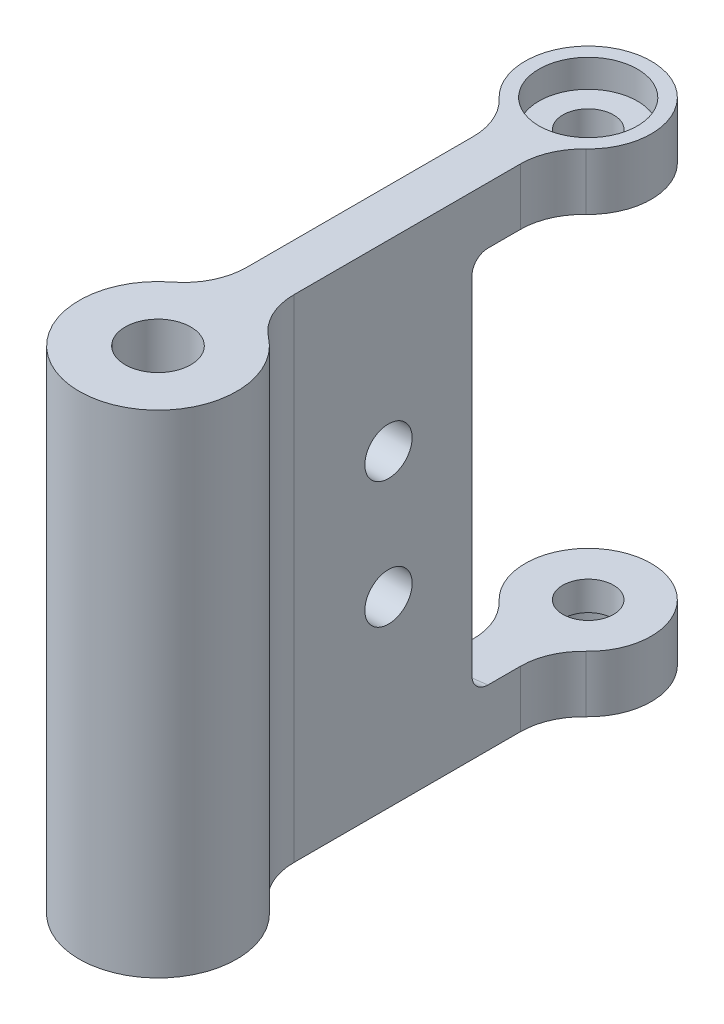
ISO-10303-21;
HEADER;
FILE_DESCRIPTION(('STEP AP214'),'2;1');
FILE_NAME('part.step','',(''),(''),'','','');
FILE_SCHEMA(('AUTOMOTIVE_DESIGN { 1 0 10303 214 1 1 1 1 }'));
ENDSEC;
DATA;
#1=APPLICATION_CONTEXT('core data for automotive mechanical design processes');
#2=APPLICATION_PROTOCOL_DEFINITION('international standard','automotive_design',2000,#1);
#3=PRODUCT_CONTEXT('',#1,'mechanical');
#4=PRODUCT('Part','Part','',(#3));
#5=PRODUCT_RELATED_PRODUCT_CATEGORY('part','',(#4));
#6=PRODUCT_DEFINITION_FORMATION('','',#4);
#7=PRODUCT_DEFINITION_CONTEXT('part definition',#1,'design');
#8=PRODUCT_DEFINITION('design','',#6,#7);
#9=PRODUCT_DEFINITION_SHAPE('','',#8);
#10=(LENGTH_UNIT() NAMED_UNIT(*) SI_UNIT(.MILLI.,.METRE.));
#11=(NAMED_UNIT(*) PLANE_ANGLE_UNIT() SI_UNIT($,.RADIAN.));
#12=(NAMED_UNIT(*) SI_UNIT($,.STERADIAN.) SOLID_ANGLE_UNIT());
#13=UNCERTAINTY_MEASURE_WITH_UNIT(LENGTH_MEASURE(1.E-05),#10,'distance_accuracy_value','');
#14=(GEOMETRIC_REPRESENTATION_CONTEXT(3) GLOBAL_UNCERTAINTY_ASSIGNED_CONTEXT((#13)) GLOBAL_UNIT_ASSIGNED_CONTEXT((#10,
#11,#12)) REPRESENTATION_CONTEXT('',''));
#15=CARTESIAN_POINT('',(0.,0.,0.));
#16=DIRECTION('',(0.,0.,1.));
#17=DIRECTION('',(1.,0.,0.));
#18=AXIS2_PLACEMENT_3D('',#15,#16,#17);
#19=CARTESIAN_POINT('',(2.38125,24.765,-7.57189241124701));
#20=DIRECTION('',(-1.,0.,0.));
#21=DIRECTION('',(0.,0.,1.));
#22=AXIS2_PLACEMENT_3D('',#19,#20,#21);
#23=PLANE('',#22);
#24=CARTESIAN_POINT('',(2.38125,-6.35,-20.8341966862152));
#25=DIRECTION('',(-1.,0.,0.));
#26=DIRECTION('',(0.,0.,1.));
#27=AXIS2_PLACEMENT_3D('',#24,#25,#26);
#28=CIRCLE('',#27,2.38125);
#29=CARTESIAN_POINT('',(2.38125,-6.35,-18.4529466862152));
#30=VERTEX_POINT('',#29);
#31=EDGE_CURVE('E274',#30,#30,#28,.T.);
#32=ORIENTED_EDGE('',*,*,#31,.T.);
#33=EDGE_LOOP('',(#32));
#34=FACE_BOUND('',#33,.T.);
#35=CARTESIAN_POINT('',(2.38125,6.35,-20.8341966862152));
#36=DIRECTION('',(-1.,0.,0.));
#37=DIRECTION('',(0.,0.,1.));
#38=AXIS2_PLACEMENT_3D('',#35,#36,#37);
#39=CIRCLE('',#38,2.38125);
#40=CARTESIAN_POINT('',(2.38125,6.35,-18.4529466862152));
#41=VERTEX_POINT('',#40);
#42=EDGE_CURVE('E277',#41,#41,#39,.T.);
#43=ORIENTED_EDGE('',*,*,#42,.T.);
#44=EDGE_LOOP('',(#43));
#45=FACE_BOUND('',#44,.T.);
#46=DIRECTION('',(0.,0.,-1.));
#47=VECTOR('',#46,1.);
#48=CARTESIAN_POINT('',(2.38125,-19.05,-7.57189241124701));
#49=LINE('',#48,#47);
#50=CARTESIAN_POINT('',(2.38125,-19.05,-30.8555569469439));
#51=VERTEX_POINT('',#50);
#52=CARTESIAN_POINT('',(2.38125,-19.05,-34.1077758099045));
#53=VERTEX_POINT('',#52);
#54=EDGE_CURVE('E280',#51,#53,#49,.T.);
#55=ORIENTED_EDGE('',*,*,#54,.F.);
#56=CARTESIAN_POINT('',(2.38125,-19.05,-30.8555569469439));
#57=CARTESIAN_POINT('',(2.38125,-19.0499992867179,-30.8096056035455));
#58=CARTESIAN_POINT('',(2.38125,-19.0480738026498,-30.7636757479676));
#59=CARTESIAN_POINT('',(2.38125,-19.0403849760383,-30.6721383530328));
#60=CARTESIAN_POINT('',(2.38125,-19.0346216155552,-30.6265308151836));
#61=CARTESIAN_POINT('',(2.38125,-19.0116090109599,-30.4907101362984));
#62=CARTESIAN_POINT('',(2.38125,-18.9886371820563,-30.4013975082349));
#63=CARTESIAN_POINT('',(2.38125,-18.9279784534315,-30.227887691741));
#64=CARTESIAN_POINT('',(2.38125,-18.8902807008964,-30.1436943291515));
#65=CARTESIAN_POINT('',(2.38125,-18.8011589501134,-29.9829318272908));
#66=CARTESIAN_POINT('',(2.38125,-18.7497398609331,-29.906359974706));
#67=CARTESIAN_POINT('',(2.38125,-18.6351250340284,-29.7638199379934));
#68=CARTESIAN_POINT('',(2.38125,-18.5720472776312,-29.6977568819243));
#69=CARTESIAN_POINT('',(2.38125,-18.4355248312356,-29.5773423799119));
#70=CARTESIAN_POINT('',(2.38125,-18.3620783628532,-29.5229929470731));
#71=CARTESIAN_POINT('',(2.38125,-18.2081180196881,-29.4284359399353));
#72=CARTESIAN_POINT('',(2.38125,-18.1277270112916,-29.3880280214473));
#73=CARTESIAN_POINT('',(2.38125,-17.9612662380821,-29.3215004354665));
#74=CARTESIAN_POINT('',(2.38125,-17.8752010590147,-29.2953693845669));
#75=CARTESIAN_POINT('',(2.38125,-17.7341591299313,-29.2654323997068));
#76=CARTESIAN_POINT('',(2.38125,-17.6801421985642,-29.25689453853));
#77=CARTESIAN_POINT('',(2.38125,-17.5715918054417,-29.2455061322711));
#78=CARTESIAN_POINT('',(2.38125,-17.5170592102065,-29.2426473250655));
#79=CARTESIAN_POINT('',(2.38125,-17.4625,-29.2426524195549));
#80=B_SPLINE_CURVE_WITH_KNOTS('',3,(#56,#57,#58,#59,#60,#61,#62,#63,#64,#65,#66,#67,#68,#69,#70,
#71,#72,#73,#74,#75,#76,#77,#78,#79),.UNSPECIFIED.,.F.,.F.,(4,2,2,2,2,2,2,2,2,2,2,4),(0.,
0.137770694944234,0.275542033890043,0.550784281844807,0.826229763627225,1.10157683139496,
1.37427653960439,1.64702307670842,1.91566871476462,2.18409983923068,2.3478890773652,
2.5114398530892),.UNSPECIFIED.);
#81=CARTESIAN_POINT('',(2.38125,-17.4625,-29.2426524195549));
#82=VERTEX_POINT('',#81);
#83=EDGE_CURVE('E212',#51,#82,#80,.T.);
#84=ORIENTED_EDGE('',*,*,#83,.T.);
#85=DIRECTION('',(0.,1.,0.));
#86=VECTOR('',#85,1.);
#87=CARTESIAN_POINT('',(2.38125,-19.05,-29.2426524195549));
#88=LINE('',#87,#86);
#89=CARTESIAN_POINT('',(2.38125,17.4625,-29.2426524195549));
#90=VERTEX_POINT('',#89);
#91=EDGE_CURVE('E286',#82,#90,#88,.T.);
#92=ORIENTED_EDGE('',*,*,#91,.T.);
#93=CARTESIAN_POINT('',(2.38125,17.4625,-29.2426524195549));
#94=CARTESIAN_POINT('',(2.38125,17.5066950806007,-29.242652422714));
#95=CARTESIAN_POINT('',(2.38125,17.5508688452441,-29.2445253474146));
#96=CARTESIAN_POINT('',(2.38125,17.638897097581,-29.2519952114394));
#97=CARTESIAN_POINT('',(2.38125,17.6827516083863,-29.2575918784246));
#98=CARTESIAN_POINT('',(2.38125,17.8132557416644,-29.2799051902684));
#99=CARTESIAN_POINT('',(2.38125,17.8990260365994,-29.3021453506062));
#100=CARTESIAN_POINT('',(2.38125,18.0656045750555,-29.3606924701043));
#101=CARTESIAN_POINT('',(2.38125,18.1464110360214,-29.3970044487573));
#102=CARTESIAN_POINT('',(2.38125,18.3008311204054,-29.4826034628934));
#103=CARTESIAN_POINT('',(2.38125,18.3744452791795,-29.5318895316449));
#104=CARTESIAN_POINT('',(2.38125,18.512865302689,-29.6422974998075));
#105=CARTESIAN_POINT('',(2.38125,18.5776188097111,-29.703484980099));
#106=CARTESIAN_POINT('',(2.38125,18.6961097513137,-29.8357458273457));
#107=CARTESIAN_POINT('',(2.38125,18.7498449246878,-29.9068212185063));
#108=CARTESIAN_POINT('',(2.38125,18.8455461926591,-30.0578449837023));
#109=CARTESIAN_POINT('',(2.38125,18.8873429267125,-30.1379005494395));
#110=CARTESIAN_POINT('',(2.38125,18.9571162451861,-30.3038113727058));
#111=CARTESIAN_POINT('',(2.38125,18.9850973770541,-30.3896647112888));
#112=CARTESIAN_POINT('',(2.38125,19.0205194656907,-30.5391634127967));
#113=CARTESIAN_POINT('',(2.38125,19.0315714858016,-30.6019791770436));
#114=CARTESIAN_POINT('',(2.38125,19.0463113515889,-30.7283753379382));
#115=CARTESIAN_POINT('',(2.38125,19.0500099990971,-30.7919544747889));
#116=CARTESIAN_POINT('',(2.38125,19.05,-30.8555569469439));
#117=B_SPLINE_CURVE_WITH_KNOTS('',3,(#93,#94,#95,#96,#97,#98,#99,#100,#101,#102,#103,#104,#105,
#106,#107,#108,#109,#110,#111,#112,#113,#114,#115,#116),.UNSPECIFIED.,.F.,.F.,(4,2,2,2,2,2,2,2,
2,2,2,4),(0.,0.132503308854566,0.264996928036795,0.52945086893184,0.793999228917779,
1.05852788232661,1.32455773185319,1.59064212208271,1.86033243089629,2.12993391104056,
2.32086847096147,2.51152234724219),.UNSPECIFIED.);
#118=CARTESIAN_POINT('',(2.38125,19.05,-30.8555569469439));
#119=VERTEX_POINT('',#118);
#120=EDGE_CURVE('E46',#90,#119,#117,.T.);
#121=ORIENTED_EDGE('',*,*,#120,.T.);
#122=DIRECTION('',(0.,0.,-1.));
#123=VECTOR('',#122,1.);
#124=CARTESIAN_POINT('',(2.38125,19.05,-7.57189241124701));
#125=LINE('',#124,#123);
#126=CARTESIAN_POINT('',(2.38125,19.05,-34.1077758099045));
#127=VERTEX_POINT('',#126);
#128=EDGE_CURVE('E335',#119,#127,#125,.T.);
#129=ORIENTED_EDGE('',*,*,#128,.T.);
#130=DIRECTION('',(0.,1.,0.));
#131=VECTOR('',#130,1.);
#132=CARTESIAN_POINT('',(2.38125,24.765,-34.1077758099045));
#133=LINE('',#132,#131);
#134=CARTESIAN_POINT('',(2.38125,24.765,-34.1077758099045));
#135=VERTEX_POINT('',#134);
#136=EDGE_CURVE('E331',#127,#135,#133,.T.);
#137=ORIENTED_EDGE('',*,*,#136,.T.);
#138=DIRECTION('',(0.,0.,-1.));
#139=VECTOR('',#138,1.);
#140=CARTESIAN_POINT('',(2.38125,24.765,-7.57189241124701));
#141=LINE('',#140,#139);
#142=CARTESIAN_POINT('',(2.38125,24.765,-11.3091966862152));
#143=VERTEX_POINT('',#142);
#144=EDGE_CURVE('E304',#143,#135,#141,.T.);
#145=ORIENTED_EDGE('',*,*,#144,.F.);
#146=DIRECTION('',(0.,1.,0.));
#147=VECTOR('',#146,1.);
#148=CARTESIAN_POINT('',(2.38125,-24.765,-11.3091966862152));
#149=LINE('',#148,#147);
#150=CARTESIAN_POINT('',(2.38125,-24.765,-11.3091966862152));
#151=VERTEX_POINT('',#150);
#152=EDGE_CURVE('E174',#143,#151,#149,.F.);
#153=ORIENTED_EDGE('',*,*,#152,.T.);
#154=DIRECTION('',(0.,0.,-1.));
#155=VECTOR('',#154,1.);
#156=CARTESIAN_POINT('',(2.38125,-24.765,-7.57189241124701));
#157=LINE('',#156,#155);
#158=CARTESIAN_POINT('',(2.38125,-24.765,-34.1077758099045));
#159=VERTEX_POINT('',#158);
#160=EDGE_CURVE('E316',#151,#159,#157,.T.);
#161=ORIENTED_EDGE('',*,*,#160,.T.);
#162=EDGE_CURVE('E179',#159,#53,#133,.T.);
#163=ORIENTED_EDGE('',*,*,#162,.T.);
#164=EDGE_LOOP('',(#55,#84,#92,#121,#129,#137,#145,#153,#161,#163));
#165=FACE_BOUND('',#164,.T.);
#166=ADVANCED_FACE('F33',(#34,#45,#165),#23,.F.);
#167=CARTESIAN_POINT('',(0.,24.765,-43.3303174030609));
#168=DIRECTION('',(0.,-1.,0.));
#169=DIRECTION('',(0.,0.,-1.));
#170=AXIS2_PLACEMENT_3D('',#167,#168,#169);
#171=CYLINDRICAL_SURFACE('',#170,6.35);
#172=CARTESIAN_POINT('',(0.,-19.05,-43.3303174030609));
#173=DIRECTION('',(0.,1.,0.));
#174=DIRECTION('',(0.,0.,1.));
#175=AXIS2_PLACEMENT_3D('',#172,#173,#174);
#176=CIRCLE('',#175,6.35);
#177=CARTESIAN_POINT('',(4.365625,-19.05,-38.7190466064827));
#178=VERTEX_POINT('',#177);
#179=CARTESIAN_POINT('',(-4.365625,-19.05,-38.7190466064827));
#180=VERTEX_POINT('',#179);
#181=EDGE_CURVE('E291',#178,#180,#176,.T.);
#182=ORIENTED_EDGE('',*,*,#181,.F.);
#183=DIRECTION('',(0.,-1.,0.));
#184=VECTOR('',#183,1.);
#185=CARTESIAN_POINT('',(4.365625,24.765,-38.7190466064827));
#186=LINE('',#185,#184);
#187=CARTESIAN_POINT('',(4.365625,-24.765,-38.7190466064827));
#188=VERTEX_POINT('',#187);
#189=EDGE_CURVE('E177',#178,#188,#186,.T.);
#190=ORIENTED_EDGE('',*,*,#189,.T.);
#191=CARTESIAN_POINT('',(0.,-24.765,-43.3303174030609));
#192=DIRECTION('',(0.,1.,0.));
#193=DIRECTION('',(0.,0.,1.));
#194=AXIS2_PLACEMENT_3D('',#191,#192,#193);
#195=CIRCLE('',#194,6.35);
#196=CARTESIAN_POINT('',(-4.365625,-24.765,-38.7190466064827));
#197=VERTEX_POINT('',#196);
#198=EDGE_CURVE('E318',#188,#197,#195,.T.);
#199=ORIENTED_EDGE('',*,*,#198,.T.);
#200=DIRECTION('',(0.,-1.,0.));
#201=VECTOR('',#200,1.);
#202=CARTESIAN_POINT('',(-4.365625,24.765,-38.7190466064827));
#203=LINE('',#202,#201);
#204=EDGE_CURVE('E173',#197,#180,#203,.F.);
#205=ORIENTED_EDGE('',*,*,#204,.T.);
#206=EDGE_LOOP('',(#182,#190,#199,#205));
#207=FACE_BOUND('',#206,.T.);
#208=ADVANCED_FACE('F257',(#207),#171,.T.);
#209=CARTESIAN_POINT('',(-2.38125,24.765,-37.4437098539287));
#210=DIRECTION('',(1.,0.,0.));
#211=DIRECTION('',(0.,0.,-1.));
#212=AXIS2_PLACEMENT_3D('',#209,#210,#211);
#213=PLANE('',#212);
#214=CARTESIAN_POINT('',(-2.38125,-6.35,-20.8341966862152));
#215=DIRECTION('',(-1.,0.,0.));
#216=DIRECTION('',(0.,0.,1.));
#217=AXIS2_PLACEMENT_3D('',#214,#215,#216);
#218=CIRCLE('',#217,2.38125);
#219=CARTESIAN_POINT('',(-2.38125,-6.35,-18.4529466862152));
#220=VERTEX_POINT('',#219);
#221=EDGE_CURVE('E431',#220,#220,#218,.T.);
#222=ORIENTED_EDGE('',*,*,#221,.F.);
#223=EDGE_LOOP('',(#222));
#224=FACE_BOUND('',#223,.T.);
#225=CARTESIAN_POINT('',(-2.38125,6.35,-20.8341966862152));
#226=DIRECTION('',(-1.,0.,0.));
#227=DIRECTION('',(0.,0.,1.));
#228=AXIS2_PLACEMENT_3D('',#225,#226,#227);
#229=CIRCLE('',#228,2.38125);
#230=CARTESIAN_POINT('',(-2.38125,6.35,-18.4529466862152));
#231=VERTEX_POINT('',#230);
#232=EDGE_CURVE('E634',#231,#231,#229,.T.);
#233=ORIENTED_EDGE('',*,*,#232,.F.);
#234=EDGE_LOOP('',(#233));
#235=FACE_BOUND('',#234,.T.);
#236=DIRECTION('',(0.,0.,1.));
#237=VECTOR('',#236,1.);
#238=CARTESIAN_POINT('',(-2.38125,-19.05,-37.4437098539287));
#239=LINE('',#238,#237);
#240=CARTESIAN_POINT('',(-2.38125,-19.05,-34.1077758099045));
#241=VERTEX_POINT('',#240);
#242=CARTESIAN_POINT('',(-2.38125,-19.05,-30.8555569469439));
#243=VERTEX_POINT('',#242);
#244=EDGE_CURVE('E341',#241,#243,#239,.T.);
#245=ORIENTED_EDGE('',*,*,#244,.F.);
#246=DIRECTION('',(0.,1.,0.));
#247=VECTOR('',#246,1.);
#248=CARTESIAN_POINT('',(-2.38125,-24.765,-34.1077758099045));
#249=LINE('',#248,#247);
#250=CARTESIAN_POINT('',(-2.38125,-24.765,-34.1077758099045));
#251=VERTEX_POINT('',#250);
#252=EDGE_CURVE('E327',#241,#251,#249,.F.);
#253=ORIENTED_EDGE('',*,*,#252,.T.);
#254=DIRECTION('',(0.,0.,1.));
#255=VECTOR('',#254,1.);
#256=CARTESIAN_POINT('',(-2.38125,-24.765,-37.4437098539287));
#257=LINE('',#256,#255);
#258=CARTESIAN_POINT('',(-2.38125,-24.765,-11.3091966862152));
#259=VERTEX_POINT('',#258);
#260=EDGE_CURVE('E305',#251,#259,#257,.T.);
#261=ORIENTED_EDGE('',*,*,#260,.T.);
#262=DIRECTION('',(0.,1.,0.));
#263=VECTOR('',#262,1.);
#264=CARTESIAN_POINT('',(-2.38125,24.765,-11.3091966862152));
#265=LINE('',#264,#263);
#266=CARTESIAN_POINT('',(-2.38125,24.765,-11.3091966862152));
#267=VERTEX_POINT('',#266);
#268=EDGE_CURVE('E330',#259,#267,#265,.T.);
#269=ORIENTED_EDGE('',*,*,#268,.T.);
#270=DIRECTION('',(0.,0.,1.));
#271=VECTOR('',#270,1.);
#272=CARTESIAN_POINT('',(-2.38125,24.765,-37.4437098539287));
#273=LINE('',#272,#271);
#274=CARTESIAN_POINT('',(-2.38125,24.765,-34.1077758099045));
#275=VERTEX_POINT('',#274);
#276=EDGE_CURVE('E310',#275,#267,#273,.T.);
#277=ORIENTED_EDGE('',*,*,#276,.F.);
#278=CARTESIAN_POINT('',(-2.38125,19.05,-34.1077758099045));
#279=VERTEX_POINT('',#278);
#280=EDGE_CURVE('E328',#275,#279,#249,.F.);
#281=ORIENTED_EDGE('',*,*,#280,.T.);
#282=DIRECTION('',(0.,0.,1.));
#283=VECTOR('',#282,1.);
#284=CARTESIAN_POINT('',(-2.38125,19.05,-37.4437098539287));
#285=LINE('',#284,#283);
#286=CARTESIAN_POINT('',(-2.38125,19.05,-30.8555569469439));
#287=VERTEX_POINT('',#286);
#288=EDGE_CURVE('E153',#279,#287,#285,.T.);
#289=ORIENTED_EDGE('',*,*,#288,.T.);
#290=CARTESIAN_POINT('',(-2.38125,19.05,-30.8555569469439));
#291=CARTESIAN_POINT('',(-2.38125,19.0499992867179,-30.8096056035455));
#292=CARTESIAN_POINT('',(-2.38125,19.0480738026498,-30.7636757479676));
#293=CARTESIAN_POINT('',(-2.38125,19.0403849760383,-30.6721383530328));
#294=CARTESIAN_POINT('',(-2.38125,19.0346216155552,-30.6265308151836));
#295=CARTESIAN_POINT('',(-2.38125,19.0116090109599,-30.4907101362984));
#296=CARTESIAN_POINT('',(-2.38125,18.9886371820563,-30.4013975082349));
#297=CARTESIAN_POINT('',(-2.38125,18.9279784534315,-30.227887691741));
#298=CARTESIAN_POINT('',(-2.38125,18.8902807008964,-30.1436943291515));
#299=CARTESIAN_POINT('',(-2.38125,18.8011589501134,-29.9829318272908));
#300=CARTESIAN_POINT('',(-2.38125,18.7497398609331,-29.906359974706));
#301=CARTESIAN_POINT('',(-2.38125,18.6351250340284,-29.7638199379934));
#302=CARTESIAN_POINT('',(-2.38125,18.5720472776312,-29.6977568819243));
#303=CARTESIAN_POINT('',(-2.38125,18.4355248312356,-29.5773423799119));
#304=CARTESIAN_POINT('',(-2.38125,18.3620783628532,-29.5229929470731));
#305=CARTESIAN_POINT('',(-2.38125,18.2081180196881,-29.4284359399353));
#306=CARTESIAN_POINT('',(-2.38125,18.1277270112916,-29.3880280214473));
#307=CARTESIAN_POINT('',(-2.38125,17.9612662380821,-29.3215004354665));
#308=CARTESIAN_POINT('',(-2.38125,17.8752010590148,-29.2953693845669));
#309=CARTESIAN_POINT('',(-2.38125,17.7341591299313,-29.2654323997068));
#310=CARTESIAN_POINT('',(-2.38125,17.6801421985642,-29.25689453853));
#311=CARTESIAN_POINT('',(-2.38125,17.5715918054417,-29.2455061322711));
#312=CARTESIAN_POINT('',(-2.38125,17.5170592102065,-29.2426473250655));
#313=CARTESIAN_POINT('',(-2.38125,17.4625,-29.2426524195549));
#314=B_SPLINE_CURVE_WITH_KNOTS('',3,(#290,#291,#292,#293,#294,#295,#296,#297,#298,#299,#300,
#301,#302,#303,#304,#305,#306,#307,#308,#309,#310,#311,#312,#313),.UNSPECIFIED.,.F.,.F.,(4,2,2,
2,2,2,2,2,2,2,2,4),(0.,0.137770694944237,0.275542033890043,0.550784281844806,0.826229763627228,
1.10157683139496,1.37427653960439,1.64702307670842,1.91566871476461,2.18409983923067,
2.3478890773652,2.5114398530892),.UNSPECIFIED.);
#315=CARTESIAN_POINT('',(-2.38125,17.4625,-29.2426524195549));
#316=VERTEX_POINT('',#315);
#317=EDGE_CURVE('E11',#287,#316,#314,.T.);
#318=ORIENTED_EDGE('',*,*,#317,.T.);
#319=DIRECTION('',(0.,1.,0.));
#320=VECTOR('',#319,1.);
#321=CARTESIAN_POINT('',(-2.38125,-19.05,-29.2426524195549));
#322=LINE('',#321,#320);
#323=CARTESIAN_POINT('',(-2.38125,-17.4625,-29.2426524195549));
#324=VERTEX_POINT('',#323);
#325=EDGE_CURVE('E200',#316,#324,#322,.F.);
#326=ORIENTED_EDGE('',*,*,#325,.T.);
#327=CARTESIAN_POINT('',(-2.38125,-17.4625,-29.2426524195549));
#328=CARTESIAN_POINT('',(-2.38125,-17.5066950806007,-29.242652422714));
#329=CARTESIAN_POINT('',(-2.38125,-17.5508688452441,-29.2445253474146));
#330=CARTESIAN_POINT('',(-2.38125,-17.638897097581,-29.2519952114394));
#331=CARTESIAN_POINT('',(-2.38125,-17.6827516083863,-29.2575918784246));
#332=CARTESIAN_POINT('',(-2.38125,-17.8132557416644,-29.2799051902684));
#333=CARTESIAN_POINT('',(-2.38125,-17.8990260365994,-29.3021453506062));
#334=CARTESIAN_POINT('',(-2.38125,-18.0656045750555,-29.3606924701043));
#335=CARTESIAN_POINT('',(-2.38125,-18.1464110360214,-29.3970044487573));
#336=CARTESIAN_POINT('',(-2.38125,-18.3008311204054,-29.4826034628934));
#337=CARTESIAN_POINT('',(-2.38125,-18.3744452791795,-29.5318895316449));
#338=CARTESIAN_POINT('',(-2.38125,-18.512865302689,-29.6422974998075));
#339=CARTESIAN_POINT('',(-2.38125,-18.5776188097111,-29.703484980099));
#340=CARTESIAN_POINT('',(-2.38125,-18.6961097513137,-29.8357458273457));
#341=CARTESIAN_POINT('',(-2.38125,-18.7498449246878,-29.9068212185063));
#342=CARTESIAN_POINT('',(-2.38125,-18.8455461926591,-30.0578449837023));
#343=CARTESIAN_POINT('',(-2.38125,-18.8873429267125,-30.1379005494395));
#344=CARTESIAN_POINT('',(-2.38125,-18.9571162451861,-30.3038113727058));
#345=CARTESIAN_POINT('',(-2.38125,-18.9850973770541,-30.3896647112888));
#346=CARTESIAN_POINT('',(-2.38125,-19.0205194656907,-30.5391634127967));
#347=CARTESIAN_POINT('',(-2.38125,-19.0315714858016,-30.6019791770436));
#348=CARTESIAN_POINT('',(-2.38125,-19.0463113515889,-30.7283753379382));
#349=CARTESIAN_POINT('',(-2.38125,-19.0500099990971,-30.7919544747889));
#350=CARTESIAN_POINT('',(-2.38125,-19.05,-30.8555569469439));
#351=B_SPLINE_CURVE_WITH_KNOTS('',3,(#327,#328,#329,#330,#331,#332,#333,#334,#335,#336,#337,
#338,#339,#340,#341,#342,#343,#344,#345,#346,#347,#348,#349,#350),.UNSPECIFIED.,.F.,.F.,(4,2,2,
2,2,2,2,2,2,2,2,4),(0.,0.132503308854566,0.264996928036795,0.52945086893184,0.793999228917774,
1.05852788232661,1.3245577318532,1.59064212208271,1.86033243089629,2.12993391104056,
2.32086847096147,2.51152234724219),.UNSPECIFIED.);
#352=EDGE_CURVE('E218',#324,#243,#351,.T.);
#353=ORIENTED_EDGE('',*,*,#352,.T.);
#354=EDGE_LOOP('',(#245,#253,#261,#269,#277,#281,#289,#318,#326,#353));
#355=FACE_BOUND('',#354,.T.);
#356=ADVANCED_FACE('F269',(#224,#235,#355),#213,.F.);
#357=CARTESIAN_POINT('',(8.73125,24.765,-34.1077758099045));
#358=DIRECTION('',(0.,-1.,0.));
#359=DIRECTION('',(0.,0.,-1.));
#360=AXIS2_PLACEMENT_3D('',#357,#358,#359);
#361=CYLINDRICAL_SURFACE('',#360,6.35);
#362=CARTESIAN_POINT('',(8.73125,-19.05,-34.1077758099045));
#363=DIRECTION('',(0.,1.,0.));
#364=DIRECTION('',(0.,0.,1.));
#365=AXIS2_PLACEMENT_3D('',#362,#363,#364);
#366=CIRCLE('',#365,6.35);
#367=EDGE_CURVE('E287',#53,#178,#366,.F.);
#368=ORIENTED_EDGE('',*,*,#367,.F.);
#369=ORIENTED_EDGE('',*,*,#162,.F.);
#370=CARTESIAN_POINT('',(8.73125,-24.765,-34.1077758099045));
#371=DIRECTION('',(0.,1.,0.));
#372=DIRECTION('',(0.,0.,1.));
#373=AXIS2_PLACEMENT_3D('',#370,#371,#372);
#374=CIRCLE('',#373,6.35);
#375=EDGE_CURVE('E192',#188,#159,#374,.T.);
#376=ORIENTED_EDGE('',*,*,#375,.F.);
#377=ORIENTED_EDGE('',*,*,#189,.F.);
#378=EDGE_LOOP('',(#368,#369,#376,#377));
#379=FACE_BOUND('',#378,.T.);
#380=ADVANCED_FACE('F241',(#379),#361,.F.);
#381=CARTESIAN_POINT('',(-8.73125,24.765,-34.1077758099045));
#382=DIRECTION('',(0.,-1.,0.));
#383=DIRECTION('',(0.,0.,-1.));
#384=AXIS2_PLACEMENT_3D('',#381,#382,#383);
#385=CYLINDRICAL_SURFACE('',#384,6.35);
#386=CARTESIAN_POINT('',(-8.73125,-19.05,-34.1077758099045));
#387=DIRECTION('',(0.,1.,0.));
#388=DIRECTION('',(0.,0.,1.));
#389=AXIS2_PLACEMENT_3D('',#386,#387,#388);
#390=CIRCLE('',#389,6.35);
#391=EDGE_CURVE('E158',#180,#241,#390,.F.);
#392=ORIENTED_EDGE('',*,*,#391,.F.);
#393=ORIENTED_EDGE('',*,*,#204,.F.);
#394=CARTESIAN_POINT('',(-8.73125,-24.765,-34.1077758099045));
#395=DIRECTION('',(0.,1.,0.));
#396=DIRECTION('',(0.,0.,1.));
#397=AXIS2_PLACEMENT_3D('',#394,#395,#396);
#398=CIRCLE('',#397,6.35);
#399=EDGE_CURVE('E196',#251,#197,#398,.T.);
#400=ORIENTED_EDGE('',*,*,#399,.F.);
#401=ORIENTED_EDGE('',*,*,#252,.F.);
#402=EDGE_LOOP('',(#392,#393,#400,#401));
#403=FACE_BOUND('',#402,.T.);
#404=ADVANCED_FACE('F236',(#403),#385,.F.);
#405=CARTESIAN_POINT('',(0.,24.765,0.));
#406=DIRECTION('',(0.,1.,0.));
#407=DIRECTION('',(0.,0.,1.));
#408=AXIS2_PLACEMENT_3D('',#405,#406,#407);
#409=PLANE('',#408);
#410=CARTESIAN_POINT('',(0.,24.765,-43.3303174030609));
#411=DIRECTION('',(0.,1.,0.));
#412=DIRECTION('',(0.,0.,1.));
#413=AXIS2_PLACEMENT_3D('',#410,#411,#412);
#414=CIRCLE('',#413,4.96062);
#415=CARTESIAN_POINT('',(0.,24.765,-38.3696974030609));
#416=VERTEX_POINT('',#415);
#417=EDGE_CURVE('E448',#416,#416,#414,.T.);
#418=ORIENTED_EDGE('',*,*,#417,.F.);
#419=EDGE_LOOP('',(#418));
#420=FACE_BOUND('',#419,.T.);
#421=ORIENTED_EDGE('',*,*,#276,.T.);
#422=CARTESIAN_POINT('',(-8.73125,24.765,-11.3091966862152));
#423=DIRECTION('',(0.,1.,0.));
#424=DIRECTION('',(0.,0.,1.));
#425=AXIS2_PLACEMENT_3D('',#422,#423,#424);
#426=CIRCLE('',#425,6.35);
#427=CARTESIAN_POINT('',(-4.85069444444444,24.765,-6.28288704789732));
#428=VERTEX_POINT('',#427);
#429=EDGE_CURVE('E186',#267,#428,#426,.F.);
#430=ORIENTED_EDGE('',*,*,#429,.T.);
#431=CARTESIAN_POINT('',(0.,24.765,0.));
#432=DIRECTION('',(0.,1.,0.));
#433=DIRECTION('',(0.,0.,1.));
#434=AXIS2_PLACEMENT_3D('',#431,#432,#433);
#435=CIRCLE('',#434,7.9375);
#436=CARTESIAN_POINT('',(4.85069444444444,24.765,-6.28288704789732));
#437=VERTEX_POINT('',#436);
#438=EDGE_CURVE('E301',#428,#437,#435,.T.);
#439=ORIENTED_EDGE('',*,*,#438,.T.);
#440=CARTESIAN_POINT('',(8.73125,24.765,-11.3091966862152));
#441=DIRECTION('',(0.,1.,0.));
#442=DIRECTION('',(0.,0.,1.));
#443=AXIS2_PLACEMENT_3D('',#440,#441,#442);
#444=CIRCLE('',#443,6.35);
#445=EDGE_CURVE('E190',#437,#143,#444,.F.);
#446=ORIENTED_EDGE('',*,*,#445,.T.);
#447=ORIENTED_EDGE('',*,*,#144,.T.);
#448=CARTESIAN_POINT('',(8.73125,24.765,-34.1077758099045));
#449=DIRECTION('',(0.,1.,0.));
#450=DIRECTION('',(0.,0.,1.));
#451=AXIS2_PLACEMENT_3D('',#448,#449,#450);
#452=CIRCLE('',#451,6.35);
#453=CARTESIAN_POINT('',(4.365625,24.765,-38.7190466064827));
#454=VERTEX_POINT('',#453);
#455=EDGE_CURVE('E194',#135,#454,#452,.F.);
#456=ORIENTED_EDGE('',*,*,#455,.T.);
#457=CARTESIAN_POINT('',(0.,24.765,-43.3303174030609));
#458=DIRECTION('',(0.,1.,0.));
#459=DIRECTION('',(0.,0.,1.));
#460=AXIS2_PLACEMENT_3D('',#457,#458,#459);
#461=CIRCLE('',#460,6.35);
#462=CARTESIAN_POINT('',(-4.365625,24.765,-38.7190466064827));
#463=VERTEX_POINT('',#462);
#464=EDGE_CURVE('E308',#454,#463,#461,.T.);
#465=ORIENTED_EDGE('',*,*,#464,.T.);
#466=CARTESIAN_POINT('',(-8.73125,24.765,-34.1077758099045));
#467=DIRECTION('',(0.,1.,0.));
#468=DIRECTION('',(0.,0.,1.));
#469=AXIS2_PLACEMENT_3D('',#466,#467,#468);
#470=CIRCLE('',#469,6.35);
#471=EDGE_CURVE('E159',#463,#275,#470,.F.);
#472=ORIENTED_EDGE('',*,*,#471,.T.);
#473=EDGE_LOOP('',(#421,#430,#439,#446,#447,#456,#465,#472));
#474=FACE_BOUND('',#473,.T.);
#475=CARTESIAN_POINT('',(0.,24.765,0.));
#476=DIRECTION('',(0.,1.,0.));
#477=DIRECTION('',(0.,0.,1.));
#478=AXIS2_PLACEMENT_3D('',#475,#476,#477);
#479=CIRCLE('',#478,3.302);
#480=CARTESIAN_POINT('',(0.,24.765,3.302));
#481=VERTEX_POINT('',#480);
#482=EDGE_CURVE('E295',#481,#481,#479,.T.);
#483=ORIENTED_EDGE('',*,*,#482,.F.);
#484=EDGE_LOOP('',(#483));
#485=FACE_BOUND('',#484,.T.);
#486=ADVANCED_FACE('F258',(#420,#474,#485),#409,.T.);
#487=CARTESIAN_POINT('',(0.,-24.765,0.));
#488=DIRECTION('',(0.,1.,0.));
#489=DIRECTION('',(0.,0.,1.));
#490=AXIS2_PLACEMENT_3D('',#487,#488,#489);
#491=PLANE('',#490);
#492=CARTESIAN_POINT('',(0.,-24.765,-43.3303174030609));
#493=DIRECTION('',(0.,-1.,0.));
#494=DIRECTION('',(0.,0.,-1.));
#495=AXIS2_PLACEMENT_3D('',#492,#493,#494);
#496=CIRCLE('',#495,4.96062);
#497=CARTESIAN_POINT('',(0.,-24.765,-48.2909374030609));
#498=VERTEX_POINT('',#497);
#499=EDGE_CURVE('E432',#498,#498,#496,.T.);
#500=ORIENTED_EDGE('',*,*,#499,.F.);
#501=EDGE_LOOP('',(#500));
#502=FACE_BOUND('',#501,.T.);
#503=CARTESIAN_POINT('',(0.,-24.765,0.));
#504=DIRECTION('',(0.,1.,0.));
#505=DIRECTION('',(0.,0.,1.));
#506=AXIS2_PLACEMENT_3D('',#503,#504,#505);
#507=CIRCLE('',#506,7.9375);
#508=CARTESIAN_POINT('',(-4.85069444444444,-24.765,-6.28288704789732));
#509=VERTEX_POINT('',#508);
#510=CARTESIAN_POINT('',(4.85069444444444,-24.765,-6.28288704789732));
#511=VERTEX_POINT('',#510);
#512=EDGE_CURVE('E298',#509,#511,#507,.T.);
#513=ORIENTED_EDGE('',*,*,#512,.F.);
#514=CARTESIAN_POINT('',(-8.73125,-24.765,-11.3091966862152));
#515=DIRECTION('',(0.,1.,0.));
#516=DIRECTION('',(0.,0.,1.));
#517=AXIS2_PLACEMENT_3D('',#514,#515,#516);
#518=CIRCLE('',#517,6.35);
#519=EDGE_CURVE('E184',#509,#259,#518,.T.);
#520=ORIENTED_EDGE('',*,*,#519,.T.);
#521=ORIENTED_EDGE('',*,*,#260,.F.);
#522=ORIENTED_EDGE('',*,*,#399,.T.);
#523=ORIENTED_EDGE('',*,*,#198,.F.);
#524=ORIENTED_EDGE('',*,*,#375,.T.);
#525=ORIENTED_EDGE('',*,*,#160,.F.);
#526=CARTESIAN_POINT('',(8.73125,-24.765,-11.3091966862152));
#527=DIRECTION('',(0.,1.,0.));
#528=DIRECTION('',(0.,0.,1.));
#529=AXIS2_PLACEMENT_3D('',#526,#527,#528);
#530=CIRCLE('',#529,6.35);
#531=EDGE_CURVE('E188',#151,#511,#530,.T.);
#532=ORIENTED_EDGE('',*,*,#531,.T.);
#533=EDGE_LOOP('',(#513,#520,#521,#522,#523,#524,#525,#532));
#534=FACE_BOUND('',#533,.T.);
#535=CARTESIAN_POINT('',(0.,-24.765,0.));
#536=DIRECTION('',(0.,1.,0.));
#537=DIRECTION('',(0.,0.,1.));
#538=AXIS2_PLACEMENT_3D('',#535,#536,#537);
#539=CIRCLE('',#538,3.302);
#540=CARTESIAN_POINT('',(0.,-24.765,3.302));
#541=VERTEX_POINT('',#540);
#542=EDGE_CURVE('E289',#541,#541,#539,.T.);
#543=ORIENTED_EDGE('',*,*,#542,.T.);
#544=EDGE_LOOP('',(#543));
#545=FACE_BOUND('',#544,.T.);
#546=ADVANCED_FACE('F251',(#502,#534,#545),#491,.F.);
#547=CARTESIAN_POINT('',(0.,24.765,0.));
#548=DIRECTION('',(0.,-1.,0.));
#549=DIRECTION('',(0.,0.,-1.));
#550=AXIS2_PLACEMENT_3D('',#547,#548,#549);
#551=CYLINDRICAL_SURFACE('',#550,7.9375);
#552=ORIENTED_EDGE('',*,*,#438,.F.);
#553=DIRECTION('',(0.,-1.,0.));
#554=VECTOR('',#553,1.);
#555=CARTESIAN_POINT('',(-4.85069444444445,24.765,-6.28288704789732));
#556=LINE('',#555,#554);
#557=EDGE_CURVE('E324',#428,#509,#556,.T.);
#558=ORIENTED_EDGE('',*,*,#557,.T.);
#559=ORIENTED_EDGE('',*,*,#512,.T.);
#560=DIRECTION('',(0.,-1.,0.));
#561=VECTOR('',#560,1.);
#562=CARTESIAN_POINT('',(4.85069444444445,24.765,-6.28288704789732));
#563=LINE('',#562,#561);
#564=EDGE_CURVE('E313',#511,#437,#563,.F.);
#565=ORIENTED_EDGE('',*,*,#564,.T.);
#566=EDGE_LOOP('',(#552,#558,#559,#565));
#567=FACE_BOUND('',#566,.T.);
#568=ADVANCED_FACE('F249',(#567),#551,.T.);
#569=CARTESIAN_POINT('',(4.365625,19.05,-38.7190466064827));
#570=VERTEX_POINT('',#569);
#571=EDGE_CURVE('E168',#454,#570,#186,.T.);
#572=ORIENTED_EDGE('',*,*,#571,.T.);
#573=CARTESIAN_POINT('',(0.,19.05,-43.3303174030609));
#574=DIRECTION('',(0.,1.,0.));
#575=DIRECTION('',(0.,0.,1.));
#576=AXIS2_PLACEMENT_3D('',#573,#574,#575);
#577=CIRCLE('',#576,6.35);
#578=CARTESIAN_POINT('',(-4.365625,19.05,-38.7190466064827));
#579=VERTEX_POINT('',#578);
#580=EDGE_CURVE('E151',#570,#579,#577,.T.);
#581=ORIENTED_EDGE('',*,*,#580,.T.);
#582=EDGE_CURVE('E165',#579,#463,#203,.F.);
#583=ORIENTED_EDGE('',*,*,#582,.T.);
#584=ORIENTED_EDGE('',*,*,#464,.F.);
#585=EDGE_LOOP('',(#572,#581,#583,#584));
#586=FACE_BOUND('',#585,.T.);
#587=ADVANCED_FACE('F163',(#586),#171,.T.);
#588=CARTESIAN_POINT('',(0.,24.765,0.));
#589=DIRECTION('',(0.,-1.,0.));
#590=DIRECTION('',(0.,0.,-1.));
#591=AXIS2_PLACEMENT_3D('',#588,#589,#590);
#592=CYLINDRICAL_SURFACE('',#591,3.302);
#593=ORIENTED_EDGE('',*,*,#482,.T.);
#594=EDGE_LOOP('',(#593));
#595=FACE_BOUND('',#594,.T.);
#596=ORIENTED_EDGE('',*,*,#542,.F.);
#597=EDGE_LOOP('',(#596));
#598=FACE_BOUND('',#597,.T.);
#599=ADVANCED_FACE('F247',(#595,#598),#592,.F.);
#600=CARTESIAN_POINT('',(-8.73125,24.765,-11.3091966862152));
#601=DIRECTION('',(0.,-1.,0.));
#602=DIRECTION('',(0.,0.,-1.));
#603=AXIS2_PLACEMENT_3D('',#600,#601,#602);
#604=CYLINDRICAL_SURFACE('',#603,6.35);
#605=ORIENTED_EDGE('',*,*,#429,.F.);
#606=ORIENTED_EDGE('',*,*,#268,.F.);
#607=ORIENTED_EDGE('',*,*,#519,.F.);
#608=ORIENTED_EDGE('',*,*,#557,.F.);
#609=EDGE_LOOP('',(#605,#606,#607,#608));
#610=FACE_BOUND('',#609,.T.);
#611=ADVANCED_FACE('F244',(#610),#604,.F.);
#612=CARTESIAN_POINT('',(8.73125,24.765,-11.3091966862152));
#613=DIRECTION('',(0.,-1.,0.));
#614=DIRECTION('',(0.,0.,-1.));
#615=AXIS2_PLACEMENT_3D('',#612,#613,#614);
#616=CYLINDRICAL_SURFACE('',#615,6.35);
#617=ORIENTED_EDGE('',*,*,#445,.F.);
#618=ORIENTED_EDGE('',*,*,#564,.F.);
#619=ORIENTED_EDGE('',*,*,#531,.F.);
#620=ORIENTED_EDGE('',*,*,#152,.F.);
#621=EDGE_LOOP('',(#617,#618,#619,#620));
#622=FACE_BOUND('',#621,.T.);
#623=ADVANCED_FACE('F239',(#622),#616,.F.);
#624=ORIENTED_EDGE('',*,*,#136,.F.);
#625=CARTESIAN_POINT('',(8.73125,19.05,-34.1077758099045));
#626=DIRECTION('',(0.,1.,0.));
#627=DIRECTION('',(0.,0.,1.));
#628=AXIS2_PLACEMENT_3D('',#625,#626,#627);
#629=CIRCLE('',#628,6.35);
#630=EDGE_CURVE('E169',#127,#570,#629,.F.);
#631=ORIENTED_EDGE('',*,*,#630,.T.);
#632=ORIENTED_EDGE('',*,*,#571,.F.);
#633=ORIENTED_EDGE('',*,*,#455,.F.);
#634=EDGE_LOOP('',(#624,#631,#632,#633));
#635=FACE_BOUND('',#634,.T.);
#636=ADVANCED_FACE('F235',(#635),#361,.F.);
#637=ORIENTED_EDGE('',*,*,#582,.F.);
#638=CARTESIAN_POINT('',(-8.73125,19.05,-34.1077758099045));
#639=DIRECTION('',(0.,1.,0.));
#640=DIRECTION('',(0.,0.,1.));
#641=AXIS2_PLACEMENT_3D('',#638,#639,#640);
#642=CIRCLE('',#641,6.35);
#643=EDGE_CURVE('E147',#579,#279,#642,.F.);
#644=ORIENTED_EDGE('',*,*,#643,.T.);
#645=ORIENTED_EDGE('',*,*,#280,.F.);
#646=ORIENTED_EDGE('',*,*,#471,.F.);
#647=EDGE_LOOP('',(#637,#644,#645,#646));
#648=FACE_BOUND('',#647,.T.);
#649=ADVANCED_FACE('F172',(#648),#385,.F.);
#650=CARTESIAN_POINT('',(0.,-19.05,-43.3303174030609));
#651=DIRECTION('',(0.,1.,0.));
#652=DIRECTION('',(0.,0.,1.));
#653=AXIS2_PLACEMENT_3D('',#650,#651,#652);
#654=CYLINDRICAL_SURFACE('',#653,14.2875);
#655=ORIENTED_EDGE('',*,*,#91,.F.);
#656=CARTESIAN_POINT('',(0.,-17.4625,-43.3303174030609));
#657=DIRECTION('',(0.,1.,0.));
#658=DIRECTION('',(0.,0.,1.));
#659=AXIS2_PLACEMENT_3D('',#656,#657,#658);
#660=CIRCLE('',#659,14.2875);
#661=EDGE_CURVE('E209',#82,#324,#660,.F.);
#662=ORIENTED_EDGE('',*,*,#661,.T.);
#663=ORIENTED_EDGE('',*,*,#325,.F.);
#664=CARTESIAN_POINT('',(0.,17.4625,-43.3303174030609));
#665=DIRECTION('',(0.,1.,0.));
#666=DIRECTION('',(0.,0.,1.));
#667=AXIS2_PLACEMENT_3D('',#664,#665,#666);
#668=CIRCLE('',#667,14.2875);
#669=EDGE_CURVE('E206',#316,#90,#668,.T.);
#670=ORIENTED_EDGE('',*,*,#669,.T.);
#671=EDGE_LOOP('',(#655,#662,#663,#670));
#672=FACE_BOUND('',#671,.T.);
#673=ADVANCED_FACE('F234',(#672),#654,.F.);
#674=CARTESIAN_POINT('',(0.,-19.05,-43.3303174030609));
#675=DIRECTION('',(0.,1.,0.));
#676=DIRECTION('',(0.,0.,1.));
#677=AXIS2_PLACEMENT_3D('',#674,#675,#676);
#678=PLANE('',#677);
#679=CARTESIAN_POINT('',(0.,-19.05,-43.3303174030609));
#680=DIRECTION('',(0.,1.,0.));
#681=DIRECTION('',(0.,0.,1.));
#682=AXIS2_PLACEMENT_3D('',#679,#680,#681);
#683=CIRCLE('',#682,2.5527);
#684=CARTESIAN_POINT('',(0.,-19.05,-40.7776174030609));
#685=VERTEX_POINT('',#684);
#686=EDGE_CURVE('E445',#685,#685,#683,.T.);
#687=ORIENTED_EDGE('',*,*,#686,.F.);
#688=EDGE_LOOP('',(#687));
#689=FACE_BOUND('',#688,.T.);
#690=ORIENTED_EDGE('',*,*,#244,.T.);
#691=CARTESIAN_POINT('',(0.,-19.05,-43.3303174030609));
#692=DIRECTION('',(0.,1.,0.));
#693=DIRECTION('',(0.,0.,1.));
#694=AXIS2_PLACEMENT_3D('',#691,#692,#693);
#695=CIRCLE('',#694,12.7);
#696=EDGE_CURVE('E203',#243,#51,#695,.T.);
#697=ORIENTED_EDGE('',*,*,#696,.T.);
#698=ORIENTED_EDGE('',*,*,#54,.T.);
#699=ORIENTED_EDGE('',*,*,#367,.T.);
#700=ORIENTED_EDGE('',*,*,#181,.T.);
#701=ORIENTED_EDGE('',*,*,#391,.T.);
#702=EDGE_LOOP('',(#690,#697,#698,#699,#700,#701));
#703=FACE_BOUND('',#702,.T.);
#704=ADVANCED_FACE('F348',(#689,#703),#678,.T.);
#705=CARTESIAN_POINT('',(0.,19.05,-43.3303174030609));
#706=DIRECTION('',(0.,1.,0.));
#707=DIRECTION('',(0.,0.,1.));
#708=AXIS2_PLACEMENT_3D('',#705,#706,#707);
#709=PLANE('',#708);
#710=CARTESIAN_POINT('',(0.,19.05,-43.3303174030609));
#711=DIRECTION('',(0.,1.,0.));
#712=DIRECTION('',(0.,0.,1.));
#713=AXIS2_PLACEMENT_3D('',#710,#711,#712);
#714=CIRCLE('',#713,2.5527);
#715=CARTESIAN_POINT('',(0.,19.05,-40.7776174030609));
#716=VERTEX_POINT('',#715);
#717=EDGE_CURVE('E457',#716,#716,#714,.T.);
#718=ORIENTED_EDGE('',*,*,#717,.T.);
#719=EDGE_LOOP('',(#718));
#720=FACE_BOUND('',#719,.T.);
#721=ORIENTED_EDGE('',*,*,#128,.F.);
#722=CARTESIAN_POINT('',(0.,19.05,-43.3303174030609));
#723=DIRECTION('',(0.,1.,0.));
#724=DIRECTION('',(0.,0.,1.));
#725=AXIS2_PLACEMENT_3D('',#722,#723,#724);
#726=CIRCLE('',#725,12.7);
#727=EDGE_CURVE('E59',#119,#287,#726,.F.);
#728=ORIENTED_EDGE('',*,*,#727,.T.);
#729=ORIENTED_EDGE('',*,*,#288,.F.);
#730=ORIENTED_EDGE('',*,*,#643,.F.);
#731=ORIENTED_EDGE('',*,*,#580,.F.);
#732=ORIENTED_EDGE('',*,*,#630,.F.);
#733=EDGE_LOOP('',(#721,#728,#729,#730,#731,#732));
#734=FACE_BOUND('',#733,.T.);
#735=ADVANCED_FACE('F149',(#720,#734),#709,.F.);
#736=CARTESIAN_POINT('',(0.,24.765,-43.3303174030609));
#737=DIRECTION('',(0.,1.,0.));
#738=DIRECTION('',(0.,0.,1.));
#739=AXIS2_PLACEMENT_3D('',#736,#737,#738);
#740=CYLINDRICAL_SURFACE('',#739,2.5527);
#741=ORIENTED_EDGE('',*,*,#717,.F.);
#742=EDGE_LOOP('',(#741));
#743=FACE_BOUND('',#742,.T.);
#744=CARTESIAN_POINT('',(0.,21.971,-43.3303174030609));
#745=DIRECTION('',(0.,1.,0.));
#746=DIRECTION('',(0.,0.,1.));
#747=AXIS2_PLACEMENT_3D('',#744,#745,#746);
#748=CIRCLE('',#747,2.5527);
#749=CARTESIAN_POINT('',(0.,21.971,-40.7776174030609));
#750=VERTEX_POINT('',#749);
#751=EDGE_CURVE('E454',#750,#750,#748,.T.);
#752=ORIENTED_EDGE('',*,*,#751,.T.);
#753=EDGE_LOOP('',(#752));
#754=FACE_BOUND('',#753,.T.);
#755=ADVANCED_FACE('F393',(#743,#754),#740,.F.);
#756=CARTESIAN_POINT('',(2.5527,21.971,-43.3303174030609));
#757=DIRECTION('',(0.,-1.,0.));
#758=DIRECTION('',(0.,0.,-1.));
#759=AXIS2_PLACEMENT_3D('',#756,#757,#758);
#760=PLANE('',#759);
#761=ORIENTED_EDGE('',*,*,#751,.F.);
#762=EDGE_LOOP('',(#761));
#763=FACE_BOUND('',#762,.T.);
#764=CARTESIAN_POINT('',(0.,21.971,-43.3303174030609));
#765=DIRECTION('',(0.,1.,0.));
#766=DIRECTION('',(0.,0.,1.));
#767=AXIS2_PLACEMENT_3D('',#764,#765,#766);
#768=CIRCLE('',#767,4.96062);
#769=CARTESIAN_POINT('',(0.,21.971,-38.3696974030609));
#770=VERTEX_POINT('',#769);
#771=EDGE_CURVE('E451',#770,#770,#768,.T.);
#772=ORIENTED_EDGE('',*,*,#771,.T.);
#773=EDGE_LOOP('',(#772));
#774=FACE_BOUND('',#773,.T.);
#775=ADVANCED_FACE('F400',(#763,#774),#760,.F.);
#776=CARTESIAN_POINT('',(0.,24.765,-43.3303174030609));
#777=DIRECTION('',(0.,1.,0.));
#778=DIRECTION('',(0.,0.,1.));
#779=AXIS2_PLACEMENT_3D('',#776,#777,#778);
#780=CYLINDRICAL_SURFACE('',#779,4.96062);
#781=ORIENTED_EDGE('',*,*,#771,.F.);
#782=EDGE_LOOP('',(#781));
#783=FACE_BOUND('',#782,.T.);
#784=ORIENTED_EDGE('',*,*,#417,.T.);
#785=EDGE_LOOP('',(#784));
#786=FACE_BOUND('',#785,.T.);
#787=ADVANCED_FACE('F404',(#783,#786),#780,.F.);
#788=CARTESIAN_POINT('',(0.,-24.765,-43.3303174030609));
#789=DIRECTION('',(0.,-1.,0.));
#790=DIRECTION('',(0.,0.,-1.));
#791=AXIS2_PLACEMENT_3D('',#788,#789,#790);
#792=CYLINDRICAL_SURFACE('',#791,2.5527);
#793=CARTESIAN_POINT('',(0.,-21.971,-43.3303174030609));
#794=DIRECTION('',(0.,-1.,0.));
#795=DIRECTION('',(0.,0.,-1.));
#796=AXIS2_PLACEMENT_3D('',#793,#794,#795);
#797=CIRCLE('',#796,2.5527);
#798=CARTESIAN_POINT('',(0.,-21.971,-45.8830174030609));
#799=VERTEX_POINT('',#798);
#800=EDGE_CURVE('E442',#799,#799,#797,.T.);
#801=ORIENTED_EDGE('',*,*,#800,.T.);
#802=EDGE_LOOP('',(#801));
#803=FACE_BOUND('',#802,.T.);
#804=ORIENTED_EDGE('',*,*,#686,.T.);
#805=EDGE_LOOP('',(#804));
#806=FACE_BOUND('',#805,.T.);
#807=ADVANCED_FACE('F408',(#803,#806),#792,.F.);
#808=CARTESIAN_POINT('',(2.5527,-21.971,-43.3303174030609));
#809=DIRECTION('',(0.,1.,0.));
#810=DIRECTION('',(0.,0.,1.));
#811=AXIS2_PLACEMENT_3D('',#808,#809,#810);
#812=PLANE('',#811);
#813=ORIENTED_EDGE('',*,*,#800,.F.);
#814=EDGE_LOOP('',(#813));
#815=FACE_BOUND('',#814,.T.);
#816=CARTESIAN_POINT('',(0.,-21.971,-43.3303174030609));
#817=DIRECTION('',(0.,-1.,0.));
#818=DIRECTION('',(0.,0.,-1.));
#819=AXIS2_PLACEMENT_3D('',#816,#817,#818);
#820=CIRCLE('',#819,4.96062);
#821=CARTESIAN_POINT('',(0.,-21.971,-48.2909374030609));
#822=VERTEX_POINT('',#821);
#823=EDGE_CURVE('E435',#822,#822,#820,.T.);
#824=ORIENTED_EDGE('',*,*,#823,.T.);
#825=EDGE_LOOP('',(#824));
#826=FACE_BOUND('',#825,.T.);
#827=ADVANCED_FACE('F412',(#815,#826),#812,.F.);
#828=CARTESIAN_POINT('',(0.,-24.765,-43.3303174030609));
#829=DIRECTION('',(0.,-1.,0.));
#830=DIRECTION('',(0.,0.,-1.));
#831=AXIS2_PLACEMENT_3D('',#828,#829,#830);
#832=CYLINDRICAL_SURFACE('',#831,4.96062);
#833=ORIENTED_EDGE('',*,*,#823,.F.);
#834=EDGE_LOOP('',(#833));
#835=FACE_BOUND('',#834,.T.);
#836=ORIENTED_EDGE('',*,*,#499,.T.);
#837=EDGE_LOOP('',(#836));
#838=FACE_BOUND('',#837,.T.);
#839=ADVANCED_FACE('F229',(#835,#838),#832,.F.);
#840=CARTESIAN_POINT('',(0.,-17.4625,-43.3303174030609));
#841=DIRECTION('',(0.,1.,0.));
#842=DIRECTION('',(0.,0.,1.));
#843=AXIS2_PLACEMENT_3D('',#840,#841,#842);
#844=TOROIDAL_SURFACE('',#843,12.7,1.5875);
#845=ORIENTED_EDGE('',*,*,#352,.F.);
#846=ORIENTED_EDGE('',*,*,#661,.F.);
#847=ORIENTED_EDGE('',*,*,#83,.F.);
#848=ORIENTED_EDGE('',*,*,#696,.F.);
#849=EDGE_LOOP('',(#845,#846,#847,#848));
#850=FACE_BOUND('',#849,.T.);
#851=ADVANCED_FACE('F225',(#850),#844,.F.);
#852=CARTESIAN_POINT('',(0.,17.4625,-43.3303174030609));
#853=DIRECTION('',(0.,1.,0.));
#854=DIRECTION('',(0.,0.,1.));
#855=AXIS2_PLACEMENT_3D('',#852,#853,#854);
#856=TOROIDAL_SURFACE('',#855,12.7,1.5875);
#857=ORIENTED_EDGE('',*,*,#317,.F.);
#858=ORIENTED_EDGE('',*,*,#727,.F.);
#859=ORIENTED_EDGE('',*,*,#120,.F.);
#860=ORIENTED_EDGE('',*,*,#669,.F.);
#861=EDGE_LOOP('',(#857,#858,#859,#860));
#862=FACE_BOUND('',#861,.T.);
#863=ADVANCED_FACE('F35',(#862),#856,.F.);
#864=CARTESIAN_POINT('',(7.93750000000001,6.35,-20.8341966862152));
#865=DIRECTION('',(-1.,0.,0.));
#866=DIRECTION('',(0.,0.,1.));
#867=AXIS2_PLACEMENT_3D('',#864,#865,#866);
#868=CYLINDRICAL_SURFACE('',#867,2.38125);
#869=ORIENTED_EDGE('',*,*,#232,.T.);
#870=EDGE_LOOP('',(#869));
#871=FACE_BOUND('',#870,.T.);
#872=ORIENTED_EDGE('',*,*,#42,.F.);
#873=EDGE_LOOP('',(#872));
#874=FACE_BOUND('',#873,.T.);
#875=ADVANCED_FACE('F420',(#871,#874),#868,.F.);
#876=CARTESIAN_POINT('',(7.93750000000001,-6.35,-20.8341966862152));
#877=DIRECTION('',(-1.,0.,0.));
#878=DIRECTION('',(0.,0.,1.));
#879=AXIS2_PLACEMENT_3D('',#876,#877,#878);
#880=CYLINDRICAL_SURFACE('',#879,2.38125);
#881=ORIENTED_EDGE('',*,*,#221,.T.);
#882=EDGE_LOOP('',(#881));
#883=FACE_BOUND('',#882,.T.);
#884=ORIENTED_EDGE('',*,*,#31,.F.);
#885=EDGE_LOOP('',(#884));
#886=FACE_BOUND('',#885,.T.);
#887=ADVANCED_FACE('F423',(#883,#886),#880,.F.);
#888=CLOSED_SHELL('',(#166,#208,#356,#380,#404,#486,#546,#568,#587,#599,#611,#623,#636,#649,
#673,#704,#735,#755,#775,#787,#807,#827,#839,#851,#863,#875,#887));
#889=MANIFOLD_SOLID_BREP('B2',#888);
#890=ADVANCED_BREP_SHAPE_REPRESENTATION('',(#18,#889),#14);
#891=SHAPE_DEFINITION_REPRESENTATION(#9,#890);
ENDSEC;
END-ISO-10303-21;
